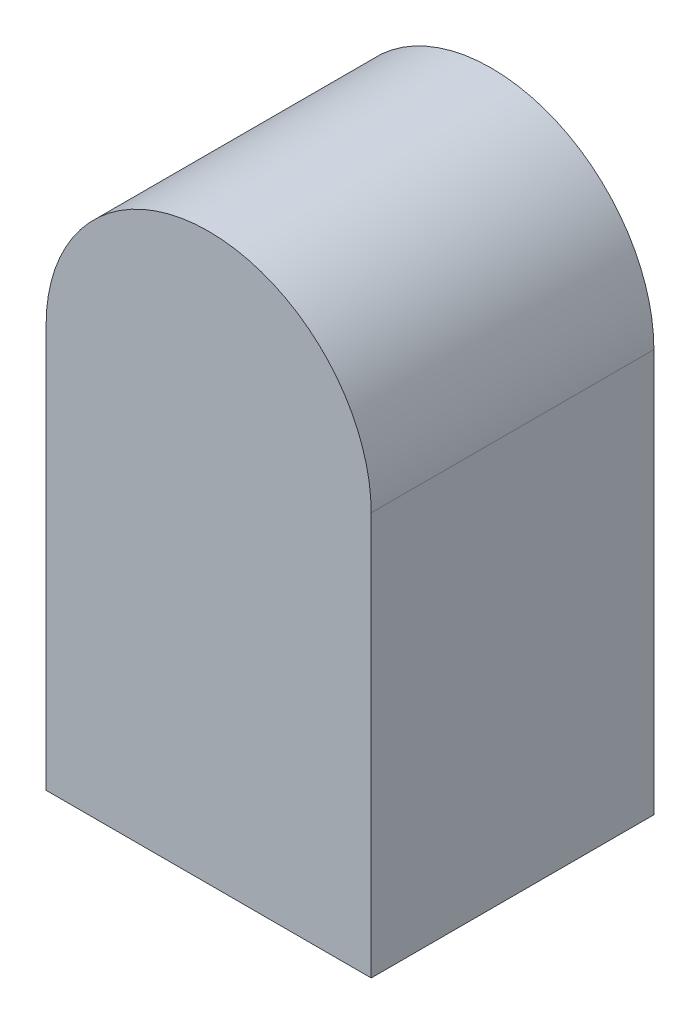
ISO-10303-21;
HEADER;
FILE_DESCRIPTION(('STEP AP214'),'2;1');
FILE_NAME('part.step','',(''),(''),'','','');
FILE_SCHEMA(('AUTOMOTIVE_DESIGN { 1 0 10303 214 1 1 1 1 }'));
ENDSEC;
DATA;
#1=APPLICATION_CONTEXT('core data for automotive mechanical design processes');
#2=APPLICATION_PROTOCOL_DEFINITION('international standard','automotive_design',2000,#1);
#3=PRODUCT_CONTEXT('',#1,'mechanical');
#4=PRODUCT('Part','Part','',(#3));
#5=PRODUCT_RELATED_PRODUCT_CATEGORY('part','',(#4));
#6=PRODUCT_DEFINITION_FORMATION('','',#4);
#7=PRODUCT_DEFINITION_CONTEXT('part definition',#1,'design');
#8=PRODUCT_DEFINITION('design','',#6,#7);
#9=PRODUCT_DEFINITION_SHAPE('','',#8);
#10=(LENGTH_UNIT() NAMED_UNIT(*) SI_UNIT(.MILLI.,.METRE.));
#11=(NAMED_UNIT(*) PLANE_ANGLE_UNIT() SI_UNIT($,.RADIAN.));
#12=(NAMED_UNIT(*) SI_UNIT($,.STERADIAN.) SOLID_ANGLE_UNIT());
#13=UNCERTAINTY_MEASURE_WITH_UNIT(LENGTH_MEASURE(1.E-05),#10,'distance_accuracy_value','');
#14=(GEOMETRIC_REPRESENTATION_CONTEXT(3) GLOBAL_UNCERTAINTY_ASSIGNED_CONTEXT((#13)) GLOBAL_UNIT_ASSIGNED_CONTEXT((#10,
#11,#12)) REPRESENTATION_CONTEXT('',''));
#15=CARTESIAN_POINT('',(0.,0.,0.));
#16=DIRECTION('',(0.,0.,1.));
#17=DIRECTION('',(1.,0.,0.));
#18=AXIS2_PLACEMENT_3D('',#15,#16,#17);
#19=CARTESIAN_POINT('',(0.249999999999999,-2.8335265642716,0.));
#20=DIRECTION('',(0.,0.,1.));
#21=DIRECTION('',(0.,1.,0.));
#22=AXIS2_PLACEMENT_3D('',#19,#20,#21);
#23=PLANE('',#22);
#24=DIRECTION('',(1.,0.,0.));
#25=VECTOR('',#24,1.);
#26=CARTESIAN_POINT('',(0.134999999999999,-3.,0.));
#27=LINE('',#26,#25);
#28=CARTESIAN_POINT('',(0.134999999999999,-3.,0.));
#29=VERTEX_POINT('',#28);
#30=CARTESIAN_POINT('',(0.364999999999999,-3.,0.));
#31=VERTEX_POINT('',#30);
#32=EDGE_CURVE('E11',#29,#31,#27,.T.);
#33=ORIENTED_EDGE('',*,*,#32,.F.);
#34=DIRECTION('',(0.,-1.,0.));
#35=VECTOR('',#34,1.);
#36=CARTESIAN_POINT('',(0.134999999999999,-2.715,0.));
#37=LINE('',#36,#35);
#38=CARTESIAN_POINT('',(0.134999999999999,-2.715,0.));
#39=VERTEX_POINT('',#38);
#40=EDGE_CURVE('E24',#39,#29,#37,.T.);
#41=ORIENTED_EDGE('',*,*,#40,.F.);
#42=CARTESIAN_POINT('',(0.249999999999999,-2.715,0.));
#43=DIRECTION('',(0.,0.,1.));
#44=DIRECTION('',(1.,0.,0.));
#45=AXIS2_PLACEMENT_3D('',#42,#43,#44);
#46=CIRCLE('',#45,0.115);
#47=CARTESIAN_POINT('',(0.364999999999999,-2.715,0.));
#48=VERTEX_POINT('',#47);
#49=EDGE_CURVE('E85',#48,#39,#46,.T.);
#50=ORIENTED_EDGE('',*,*,#49,.F.);
#51=DIRECTION('',(0.,1.,0.));
#52=VECTOR('',#51,1.);
#53=CARTESIAN_POINT('',(0.364999999999999,-3.,0.));
#54=LINE('',#53,#52);
#55=EDGE_CURVE('E82',#31,#48,#54,.T.);
#56=ORIENTED_EDGE('',*,*,#55,.F.);
#57=EDGE_LOOP('',(#33,#41,#50,#56));
#58=FACE_BOUND('',#57,.T.);
#59=ADVANCED_FACE('F17',(#58),#23,.F.);
#60=CARTESIAN_POINT('',(0.364999999999999,-3.,0.));
#61=DIRECTION('',(1.,0.,0.));
#62=DIRECTION('',(0.,1.,0.));
#63=AXIS2_PLACEMENT_3D('',#60,#61,#62);
#64=PLANE('',#63);
#65=ORIENTED_EDGE('',*,*,#55,.T.);
#66=DIRECTION('',(0.,0.,1.));
#67=VECTOR('',#66,1.);
#68=CARTESIAN_POINT('',(0.364999999999999,-2.715,0.));
#69=LINE('',#68,#67);
#70=CARTESIAN_POINT('',(0.364999999999999,-2.715,0.2));
#71=VERTEX_POINT('',#70);
#72=EDGE_CURVE('E80',#48,#71,#69,.T.);
#73=ORIENTED_EDGE('',*,*,#72,.T.);
#74=DIRECTION('',(0.,1.,0.));
#75=VECTOR('',#74,1.);
#76=CARTESIAN_POINT('',(0.364999999999999,-3.,0.2));
#77=LINE('',#76,#75);
#78=CARTESIAN_POINT('',(0.364999999999999,-3.,0.2));
#79=VERTEX_POINT('',#78);
#80=EDGE_CURVE('E78',#79,#71,#77,.T.);
#81=ORIENTED_EDGE('',*,*,#80,.F.);
#82=DIRECTION('',(0.,0.,-1.));
#83=VECTOR('',#82,1.);
#84=CARTESIAN_POINT('',(0.364999999999999,-3.,0.));
#85=LINE('',#84,#83);
#86=EDGE_CURVE('E71',#79,#31,#85,.T.);
#87=ORIENTED_EDGE('',*,*,#86,.T.);
#88=EDGE_LOOP('',(#65,#73,#81,#87));
#89=FACE_BOUND('',#88,.T.);
#90=ADVANCED_FACE('F91',(#89),#64,.T.);
#91=CARTESIAN_POINT('',(0.249999999999999,-2.715,0.));
#92=DIRECTION('',(0.,0.,1.));
#93=DIRECTION('',(1.,0.,0.));
#94=AXIS2_PLACEMENT_3D('',#91,#92,#93);
#95=CYLINDRICAL_SURFACE('',#94,0.115);
#96=ORIENTED_EDGE('',*,*,#49,.T.);
#97=DIRECTION('',(0.,0.,1.));
#98=VECTOR('',#97,1.);
#99=CARTESIAN_POINT('',(0.134999999999999,-2.715,0.));
#100=LINE('',#99,#98);
#101=CARTESIAN_POINT('',(0.134999999999999,-2.715,0.2));
#102=VERTEX_POINT('',#101);
#103=EDGE_CURVE('E75',#39,#102,#100,.T.);
#104=ORIENTED_EDGE('',*,*,#103,.T.);
#105=CARTESIAN_POINT('',(0.249999999999999,-2.715,0.2));
#106=DIRECTION('',(0.,0.,1.));
#107=DIRECTION('',(1.,0.,0.));
#108=AXIS2_PLACEMENT_3D('',#105,#106,#107);
#109=CIRCLE('',#108,0.115);
#110=EDGE_CURVE('E59',#71,#102,#109,.T.);
#111=ORIENTED_EDGE('',*,*,#110,.F.);
#112=ORIENTED_EDGE('',*,*,#72,.F.);
#113=EDGE_LOOP('',(#96,#104,#111,#112));
#114=FACE_BOUND('',#113,.T.);
#115=ADVANCED_FACE('F89',(#114),#95,.T.);
#116=CARTESIAN_POINT('',(0.134999999999999,-2.715,0.));
#117=DIRECTION('',(-1.,0.,0.));
#118=DIRECTION('',(0.,-1.,0.));
#119=AXIS2_PLACEMENT_3D('',#116,#117,#118);
#120=PLANE('',#119);
#121=ORIENTED_EDGE('',*,*,#40,.T.);
#122=DIRECTION('',(0.,0.,1.));
#123=VECTOR('',#122,1.);
#124=CARTESIAN_POINT('',(0.134999999999999,-3.,0.));
#125=LINE('',#124,#123);
#126=CARTESIAN_POINT('',(0.134999999999999,-3.,0.2));
#127=VERTEX_POINT('',#126);
#128=EDGE_CURVE('E53',#29,#127,#125,.T.);
#129=ORIENTED_EDGE('',*,*,#128,.T.);
#130=DIRECTION('',(0.,-1.,0.));
#131=VECTOR('',#130,1.);
#132=CARTESIAN_POINT('',(0.134999999999999,-2.715,0.2));
#133=LINE('',#132,#131);
#134=EDGE_CURVE('E57',#102,#127,#133,.T.);
#135=ORIENTED_EDGE('',*,*,#134,.F.);
#136=ORIENTED_EDGE('',*,*,#103,.F.);
#137=EDGE_LOOP('',(#121,#129,#135,#136));
#138=FACE_BOUND('',#137,.T.);
#139=ADVANCED_FACE('F55',(#138),#120,.T.);
#140=CARTESIAN_POINT('',(-3.,-3.,0.));
#141=DIRECTION('',(0.,-1.,0.));
#142=DIRECTION('',(1.,0.,0.));
#143=AXIS2_PLACEMENT_3D('',#140,#141,#142);
#144=PLANE('',#143);
#145=ORIENTED_EDGE('',*,*,#86,.F.);
#146=DIRECTION('',(1.,0.,0.));
#147=VECTOR('',#146,1.);
#148=CARTESIAN_POINT('',(-1.375,-3.,0.2));
#149=LINE('',#148,#147);
#150=EDGE_CURVE('E66',#127,#79,#149,.T.);
#151=ORIENTED_EDGE('',*,*,#150,.F.);
#152=ORIENTED_EDGE('',*,*,#128,.F.);
#153=ORIENTED_EDGE('',*,*,#32,.T.);
#154=EDGE_LOOP('',(#145,#151,#152,#153));
#155=FACE_BOUND('',#154,.T.);
#156=ADVANCED_FACE('F69',(#155),#144,.T.);
#157=CARTESIAN_POINT('',(0.249999999999999,-2.8335240809167,0.2));
#158=DIRECTION('',(0.,0.,1.));
#159=DIRECTION('',(1.,0.,0.));
#160=AXIS2_PLACEMENT_3D('',#157,#158,#159);
#161=PLANE('',#160);
#162=ORIENTED_EDGE('',*,*,#134,.T.);
#163=ORIENTED_EDGE('',*,*,#150,.T.);
#164=ORIENTED_EDGE('',*,*,#80,.T.);
#165=ORIENTED_EDGE('',*,*,#110,.T.);
#166=EDGE_LOOP('',(#162,#163,#164,#165));
#167=FACE_BOUND('',#166,.T.);
#168=ADVANCED_FACE('F64',(#167),#161,.T.);
#169=CLOSED_SHELL('',(#59,#90,#115,#139,#156,#168));
#170=MANIFOLD_SOLID_BREP('B1',#169);
#171=ADVANCED_BREP_SHAPE_REPRESENTATION('',(#18,#170),#14);
#172=SHAPE_DEFINITION_REPRESENTATION(#9,#171);
ENDSEC;
END-ISO-10303-21;
